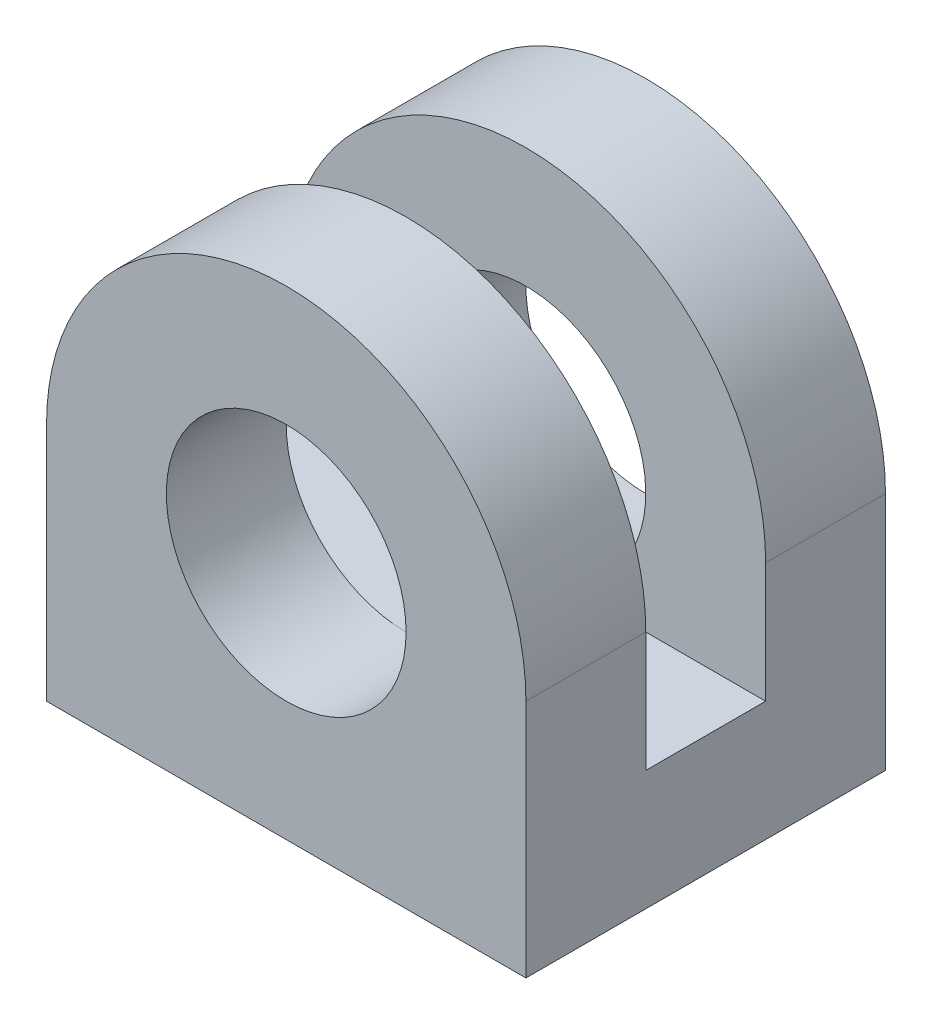
ISO-10303-21;
HEADER;
FILE_DESCRIPTION(('STEP AP214'),'2;1');
FILE_NAME('part.step','',(''),(''),'','','');
FILE_SCHEMA(('AUTOMOTIVE_DESIGN { 1 0 10303 214 1 1 1 1 }'));
ENDSEC;
DATA;
#1=APPLICATION_CONTEXT('core data for automotive mechanical design processes');
#2=APPLICATION_PROTOCOL_DEFINITION('international standard','automotive_design',2000,#1);
#3=PRODUCT_CONTEXT('',#1,'mechanical');
#4=PRODUCT('Part','Part','',(#3));
#5=PRODUCT_RELATED_PRODUCT_CATEGORY('part','',(#4));
#6=PRODUCT_DEFINITION_FORMATION('','',#4);
#7=PRODUCT_DEFINITION_CONTEXT('part definition',#1,'design');
#8=PRODUCT_DEFINITION('design','',#6,#7);
#9=PRODUCT_DEFINITION_SHAPE('','',#8);
#10=(LENGTH_UNIT() NAMED_UNIT(*) SI_UNIT(.MILLI.,.METRE.));
#11=(NAMED_UNIT(*) PLANE_ANGLE_UNIT() SI_UNIT($,.RADIAN.));
#12=(NAMED_UNIT(*) SI_UNIT($,.STERADIAN.) SOLID_ANGLE_UNIT());
#13=UNCERTAINTY_MEASURE_WITH_UNIT(LENGTH_MEASURE(1.E-05),#10,'distance_accuracy_value','');
#14=(GEOMETRIC_REPRESENTATION_CONTEXT(3) GLOBAL_UNCERTAINTY_ASSIGNED_CONTEXT((#13)) GLOBAL_UNIT_ASSIGNED_CONTEXT((#10,
#11,#12)) REPRESENTATION_CONTEXT('',''));
#15=CARTESIAN_POINT('',(0.,0.,0.));
#16=DIRECTION('',(0.,0.,1.));
#17=DIRECTION('',(1.,0.,0.));
#18=AXIS2_PLACEMENT_3D('',#15,#16,#17);
#19=CARTESIAN_POINT('',(0.,20.,15.));
#20=DIRECTION('',(0.,0.,-1.));
#21=DIRECTION('',(-1.,0.,0.));
#22=AXIS2_PLACEMENT_3D('',#19,#20,#21);
#23=CYLINDRICAL_SURFACE('',#22,20.);
#24=DIRECTION('',(0.,0.,-1.));
#25=VECTOR('',#24,1.);
#26=CARTESIAN_POINT('',(-20.,20.,15.));
#27=LINE('',#26,#25);
#28=CARTESIAN_POINT('',(-20.,20.,-5.));
#29=VERTEX_POINT('',#28);
#30=CARTESIAN_POINT('',(-20.,20.,-15.));
#31=VERTEX_POINT('',#30);
#32=EDGE_CURVE('E179',#29,#31,#27,.T.);
#33=ORIENTED_EDGE('',*,*,#32,.F.);
#34=CARTESIAN_POINT('',(0.,20.,-5.));
#35=DIRECTION('',(0.,0.,-1.));
#36=DIRECTION('',(0.,1.,0.));
#37=AXIS2_PLACEMENT_3D('',#34,#35,#36);
#38=CIRCLE('',#37,20.);
#39=CARTESIAN_POINT('',(20.,20.,-5.));
#40=VERTEX_POINT('',#39);
#41=EDGE_CURVE('E152',#29,#40,#38,.T.);
#42=ORIENTED_EDGE('',*,*,#41,.T.);
#43=DIRECTION('',(0.,0.,-1.));
#44=VECTOR('',#43,1.);
#45=CARTESIAN_POINT('',(20.,20.,15.));
#46=LINE('',#45,#44);
#47=CARTESIAN_POINT('',(20.,20.,-15.));
#48=VERTEX_POINT('',#47);
#49=EDGE_CURVE('E195',#40,#48,#46,.T.);
#50=ORIENTED_EDGE('',*,*,#49,.T.);
#51=CARTESIAN_POINT('',(0.,20.,-15.));
#52=DIRECTION('',(0.,0.,1.));
#53=DIRECTION('',(1.,0.,0.));
#54=AXIS2_PLACEMENT_3D('',#51,#52,#53);
#55=CIRCLE('',#54,20.);
#56=EDGE_CURVE('E170',#48,#31,#55,.T.);
#57=ORIENTED_EDGE('',*,*,#56,.T.);
#58=EDGE_LOOP('',(#33,#42,#50,#57));
#59=FACE_BOUND('',#58,.T.);
#60=ADVANCED_FACE('F39',(#59),#23,.T.);
#61=CARTESIAN_POINT('',(0.,20.,15.));
#62=DIRECTION('',(0.,0.,-1.));
#63=DIRECTION('',(-1.,0.,0.));
#64=AXIS2_PLACEMENT_3D('',#61,#62,#63);
#65=CYLINDRICAL_SURFACE('',#64,10.);
#66=CARTESIAN_POINT('',(0.,20.,-5.));
#67=DIRECTION('',(0.,0.,-1.));
#68=DIRECTION('',(0.,1.,0.));
#69=AXIS2_PLACEMENT_3D('',#66,#67,#68);
#70=CIRCLE('',#69,10.);
#71=CARTESIAN_POINT('',(0.,10.,-5.));
#72=VERTEX_POINT('',#71);
#73=EDGE_CURVE('E11',#72,#72,#70,.T.);
#74=ORIENTED_EDGE('',*,*,#73,.F.);
#75=EDGE_LOOP('',(#74));
#76=FACE_BOUND('',#75,.T.);
#77=CARTESIAN_POINT('',(0.,20.,-15.));
#78=DIRECTION('',(0.,0.,1.));
#79=DIRECTION('',(1.,0.,0.));
#80=AXIS2_PLACEMENT_3D('',#77,#78,#79);
#81=CIRCLE('',#80,10.);
#82=CARTESIAN_POINT('',(10.,20.,-15.));
#83=VERTEX_POINT('',#82);
#84=EDGE_CURVE('E156',#83,#83,#81,.T.);
#85=ORIENTED_EDGE('',*,*,#84,.F.);
#86=EDGE_LOOP('',(#85));
#87=FACE_BOUND('',#86,.T.);
#88=ADVANCED_FACE('F248',(#76,#87),#65,.F.);
#89=CARTESIAN_POINT('',(0.,20.,15.));
#90=DIRECTION('',(0.,0.,1.));
#91=DIRECTION('',(1.,0.,0.));
#92=AXIS2_PLACEMENT_3D('',#89,#90,#91);
#93=PLANE('',#92);
#94=DIRECTION('',(0.,-1.,0.));
#95=VECTOR('',#94,1.);
#96=CARTESIAN_POINT('',(-20.,20.,15.));
#97=LINE('',#96,#95);
#98=CARTESIAN_POINT('',(-20.,20.,15.));
#99=VERTEX_POINT('',#98);
#100=CARTESIAN_POINT('',(-20.,0.,15.));
#101=VERTEX_POINT('',#100);
#102=EDGE_CURVE('E165',#99,#101,#97,.T.);
#103=ORIENTED_EDGE('',*,*,#102,.T.);
#104=DIRECTION('',(1.,0.,0.));
#105=VECTOR('',#104,1.);
#106=CARTESIAN_POINT('',(-20.,0.,15.));
#107=LINE('',#106,#105);
#108=CARTESIAN_POINT('',(20.,0.,15.));
#109=VERTEX_POINT('',#108);
#110=EDGE_CURVE('E169',#101,#109,#107,.T.);
#111=ORIENTED_EDGE('',*,*,#110,.T.);
#112=DIRECTION('',(0.,1.,0.));
#113=VECTOR('',#112,1.);
#114=CARTESIAN_POINT('',(20.,0.,15.));
#115=LINE('',#114,#113);
#116=CARTESIAN_POINT('',(20.,20.,15.));
#117=VERTEX_POINT('',#116);
#118=EDGE_CURVE('E173',#109,#117,#115,.T.);
#119=ORIENTED_EDGE('',*,*,#118,.T.);
#120=CARTESIAN_POINT('',(0.,20.,15.));
#121=DIRECTION('',(0.,0.,1.));
#122=DIRECTION('',(1.,0.,0.));
#123=AXIS2_PLACEMENT_3D('',#120,#121,#122);
#124=CIRCLE('',#123,20.);
#125=EDGE_CURVE('E176',#117,#99,#124,.T.);
#126=ORIENTED_EDGE('',*,*,#125,.T.);
#127=EDGE_LOOP('',(#103,#111,#119,#126));
#128=FACE_BOUND('',#127,.T.);
#129=CARTESIAN_POINT('',(0.,20.,15.));
#130=DIRECTION('',(0.,0.,1.));
#131=DIRECTION('',(1.,0.,0.));
#132=AXIS2_PLACEMENT_3D('',#129,#130,#131);
#133=CIRCLE('',#132,10.);
#134=CARTESIAN_POINT('',(10.,20.,15.));
#135=VERTEX_POINT('',#134);
#136=EDGE_CURVE('E157',#135,#135,#133,.T.);
#137=ORIENTED_EDGE('',*,*,#136,.F.);
#138=EDGE_LOOP('',(#137));
#139=FACE_BOUND('',#138,.T.);
#140=ADVANCED_FACE('F234',(#128,#139),#93,.T.);
#141=CARTESIAN_POINT('',(0.,20.,-15.));
#142=DIRECTION('',(0.,0.,1.));
#143=DIRECTION('',(1.,0.,0.));
#144=AXIS2_PLACEMENT_3D('',#141,#142,#143);
#145=PLANE('',#144);
#146=DIRECTION('',(0.,-1.,0.));
#147=VECTOR('',#146,1.);
#148=CARTESIAN_POINT('',(-20.,20.,-15.));
#149=LINE('',#148,#147);
#150=CARTESIAN_POINT('',(-20.,0.,-15.));
#151=VERTEX_POINT('',#150);
#152=EDGE_CURVE('E161',#31,#151,#149,.T.);
#153=ORIENTED_EDGE('',*,*,#152,.F.);
#154=ORIENTED_EDGE('',*,*,#56,.F.);
#155=DIRECTION('',(0.,1.,0.));
#156=VECTOR('',#155,1.);
#157=CARTESIAN_POINT('',(20.,0.,-15.));
#158=LINE('',#157,#156);
#159=CARTESIAN_POINT('',(20.,0.,-15.));
#160=VERTEX_POINT('',#159);
#161=EDGE_CURVE('E186',#160,#48,#158,.T.);
#162=ORIENTED_EDGE('',*,*,#161,.F.);
#163=DIRECTION('',(1.,0.,0.));
#164=VECTOR('',#163,1.);
#165=CARTESIAN_POINT('',(-20.,0.,-15.));
#166=LINE('',#165,#164);
#167=EDGE_CURVE('E183',#151,#160,#166,.T.);
#168=ORIENTED_EDGE('',*,*,#167,.F.);
#169=EDGE_LOOP('',(#153,#154,#162,#168));
#170=FACE_BOUND('',#169,.T.);
#171=ORIENTED_EDGE('',*,*,#84,.T.);
#172=EDGE_LOOP('',(#171));
#173=FACE_BOUND('',#172,.T.);
#174=ADVANCED_FACE('F226',(#170,#173),#145,.F.);
#175=CARTESIAN_POINT('',(-20.,20.,15.));
#176=DIRECTION('',(1.,0.,0.));
#177=DIRECTION('',(0.,1.,0.));
#178=AXIS2_PLACEMENT_3D('',#175,#176,#177);
#179=PLANE('',#178);
#180=DIRECTION('',(0.,0.,-1.));
#181=VECTOR('',#180,1.);
#182=CARTESIAN_POINT('',(-20.,10.,5.));
#183=LINE('',#182,#181);
#184=CARTESIAN_POINT('',(-20.,10.,5.));
#185=VERTEX_POINT('',#184);
#186=CARTESIAN_POINT('',(-20.,10.,-5.));
#187=VERTEX_POINT('',#186);
#188=EDGE_CURVE('E121',#185,#187,#183,.T.);
#189=ORIENTED_EDGE('',*,*,#188,.T.);
#190=DIRECTION('',(0.,1.,0.));
#191=VECTOR('',#190,1.);
#192=CARTESIAN_POINT('',(-20.,10.,-5.));
#193=LINE('',#192,#191);
#194=EDGE_CURVE('E126',#187,#29,#193,.T.);
#195=ORIENTED_EDGE('',*,*,#194,.T.);
#196=ORIENTED_EDGE('',*,*,#32,.T.);
#197=ORIENTED_EDGE('',*,*,#152,.T.);
#198=DIRECTION('',(0.,0.,-1.));
#199=VECTOR('',#198,1.);
#200=CARTESIAN_POINT('',(-20.,0.,15.));
#201=LINE('',#200,#199);
#202=EDGE_CURVE('E204',#101,#151,#201,.T.);
#203=ORIENTED_EDGE('',*,*,#202,.F.);
#204=ORIENTED_EDGE('',*,*,#102,.F.);
#205=CARTESIAN_POINT('',(-20.,20.,5.));
#206=VERTEX_POINT('',#205);
#207=EDGE_CURVE('E131',#99,#206,#27,.T.);
#208=ORIENTED_EDGE('',*,*,#207,.T.);
#209=DIRECTION('',(0.,-1.,0.));
#210=VECTOR('',#209,1.);
#211=CARTESIAN_POINT('',(-20.,46.6812783255676,5.));
#212=LINE('',#211,#210);
#213=EDGE_CURVE('E55',#206,#185,#212,.T.);
#214=ORIENTED_EDGE('',*,*,#213,.T.);
#215=EDGE_LOOP('',(#189,#195,#196,#197,#203,#204,#208,#214));
#216=FACE_BOUND('',#215,.T.);
#217=ADVANCED_FACE('F41',(#216),#179,.F.);
#218=CARTESIAN_POINT('',(-20.,0.,15.));
#219=DIRECTION('',(0.,1.,0.));
#220=DIRECTION('',(-1.,0.,0.));
#221=AXIS2_PLACEMENT_3D('',#218,#219,#220);
#222=PLANE('',#221);
#223=ORIENTED_EDGE('',*,*,#167,.T.);
#224=DIRECTION('',(0.,0.,-1.));
#225=VECTOR('',#224,1.);
#226=CARTESIAN_POINT('',(20.,0.,15.));
#227=LINE('',#226,#225);
#228=EDGE_CURVE('E200',#109,#160,#227,.T.);
#229=ORIENTED_EDGE('',*,*,#228,.F.);
#230=ORIENTED_EDGE('',*,*,#110,.F.);
#231=ORIENTED_EDGE('',*,*,#202,.T.);
#232=EDGE_LOOP('',(#223,#229,#230,#231));
#233=FACE_BOUND('',#232,.T.);
#234=ADVANCED_FACE('F231',(#233),#222,.F.);
#235=CARTESIAN_POINT('',(20.,0.,15.));
#236=DIRECTION('',(-1.,0.,0.));
#237=DIRECTION('',(0.,0.,1.));
#238=AXIS2_PLACEMENT_3D('',#235,#236,#237);
#239=PLANE('',#238);
#240=ORIENTED_EDGE('',*,*,#49,.F.);
#241=DIRECTION('',(0.,1.,0.));
#242=VECTOR('',#241,1.);
#243=CARTESIAN_POINT('',(20.,10.,-5.));
#244=LINE('',#243,#242);
#245=CARTESIAN_POINT('',(20.,10.,-5.));
#246=VERTEX_POINT('',#245);
#247=EDGE_CURVE('E133',#246,#40,#244,.T.);
#248=ORIENTED_EDGE('',*,*,#247,.F.);
#249=DIRECTION('',(0.,0.,-1.));
#250=VECTOR('',#249,1.);
#251=CARTESIAN_POINT('',(20.,10.,5.));
#252=LINE('',#251,#250);
#253=CARTESIAN_POINT('',(20.,10.,5.));
#254=VERTEX_POINT('',#253);
#255=EDGE_CURVE('E136',#254,#246,#252,.T.);
#256=ORIENTED_EDGE('',*,*,#255,.F.);
#257=DIRECTION('',(0.,-1.,0.));
#258=VECTOR('',#257,1.);
#259=CARTESIAN_POINT('',(20.,46.6812783255676,5.));
#260=LINE('',#259,#258);
#261=CARTESIAN_POINT('',(20.,20.,5.));
#262=VERTEX_POINT('',#261);
#263=EDGE_CURVE('E141',#262,#254,#260,.T.);
#264=ORIENTED_EDGE('',*,*,#263,.F.);
#265=EDGE_CURVE('E196',#117,#262,#46,.T.);
#266=ORIENTED_EDGE('',*,*,#265,.F.);
#267=ORIENTED_EDGE('',*,*,#118,.F.);
#268=ORIENTED_EDGE('',*,*,#228,.T.);
#269=ORIENTED_EDGE('',*,*,#161,.T.);
#270=EDGE_LOOP('',(#240,#248,#256,#264,#266,#267,#268,#269));
#271=FACE_BOUND('',#270,.T.);
#272=ADVANCED_FACE('F218',(#271),#239,.F.);
#273=ORIENTED_EDGE('',*,*,#265,.T.);
#274=CARTESIAN_POINT('',(0.,20.,5.));
#275=DIRECTION('',(0.,0.,1.));
#276=DIRECTION('',(0.,-1.,0.));
#277=AXIS2_PLACEMENT_3D('',#274,#275,#276);
#278=CIRCLE('',#277,20.);
#279=EDGE_CURVE('E148',#262,#206,#278,.T.);
#280=ORIENTED_EDGE('',*,*,#279,.T.);
#281=ORIENTED_EDGE('',*,*,#207,.F.);
#282=ORIENTED_EDGE('',*,*,#125,.F.);
#283=EDGE_LOOP('',(#273,#280,#281,#282));
#284=FACE_BOUND('',#283,.T.);
#285=ADVANCED_FACE('F238',(#284),#23,.T.);
#286=CARTESIAN_POINT('',(0.,20.,5.));
#287=DIRECTION('',(0.,0.,1.));
#288=DIRECTION('',(0.,-1.,0.));
#289=AXIS2_PLACEMENT_3D('',#286,#287,#288);
#290=CIRCLE('',#289,10.);
#291=CARTESIAN_POINT('',(0.,10.,5.));
#292=VERTEX_POINT('',#291);
#293=EDGE_CURVE('E48',#292,#292,#290,.T.);
#294=ORIENTED_EDGE('',*,*,#293,.F.);
#295=EDGE_LOOP('',(#294));
#296=FACE_BOUND('',#295,.T.);
#297=ORIENTED_EDGE('',*,*,#136,.T.);
#298=EDGE_LOOP('',(#297));
#299=FACE_BOUND('',#298,.T.);
#300=ADVANCED_FACE('F240',(#296,#299),#65,.F.);
#301=CARTESIAN_POINT('',(-20.,10.,-5.));
#302=DIRECTION('',(0.,0.,-1.));
#303=DIRECTION('',(0.,1.,0.));
#304=AXIS2_PLACEMENT_3D('',#301,#302,#303);
#305=PLANE('',#304);
#306=ORIENTED_EDGE('',*,*,#194,.F.);
#307=DIRECTION('',(1.,0.,0.));
#308=VECTOR('',#307,1.);
#309=CARTESIAN_POINT('',(-20.,10.,-5.));
#310=LINE('',#309,#308);
#311=EDGE_CURVE('E62',#187,#72,#310,.T.);
#312=ORIENTED_EDGE('',*,*,#311,.T.);
#313=ORIENTED_EDGE('',*,*,#73,.T.);
#314=EDGE_CURVE('E117',#72,#246,#310,.T.);
#315=ORIENTED_EDGE('',*,*,#314,.T.);
#316=ORIENTED_EDGE('',*,*,#247,.T.);
#317=ORIENTED_EDGE('',*,*,#41,.F.);
#318=EDGE_LOOP('',(#306,#312,#313,#315,#316,#317));
#319=FACE_BOUND('',#318,.T.);
#320=ADVANCED_FACE('F219',(#319),#305,.F.);
#321=CARTESIAN_POINT('',(-20.,10.,5.));
#322=DIRECTION('',(0.,-1.,0.));
#323=DIRECTION('',(0.,0.,-1.));
#324=AXIS2_PLACEMENT_3D('',#321,#322,#323);
#325=PLANE('',#324);
#326=DIRECTION('',(1.,0.,0.));
#327=VECTOR('',#326,1.);
#328=CARTESIAN_POINT('',(-20.,10.,5.));
#329=LINE('',#328,#327);
#330=EDGE_CURVE('E118',#292,#254,#329,.T.);
#331=ORIENTED_EDGE('',*,*,#330,.T.);
#332=ORIENTED_EDGE('',*,*,#255,.T.);
#333=ORIENTED_EDGE('',*,*,#314,.F.);
#334=ORIENTED_EDGE('',*,*,#311,.F.);
#335=ORIENTED_EDGE('',*,*,#188,.F.);
#336=EDGE_CURVE('E109',#185,#292,#329,.T.);
#337=ORIENTED_EDGE('',*,*,#336,.T.);
#338=EDGE_LOOP('',(#331,#332,#333,#334,#335,#337));
#339=FACE_BOUND('',#338,.T.);
#340=ADVANCED_FACE('F122',(#339),#325,.F.);
#341=CARTESIAN_POINT('',(-20.,46.6812783255676,5.));
#342=DIRECTION('',(0.,0.,1.));
#343=DIRECTION('',(0.,-1.,0.));
#344=AXIS2_PLACEMENT_3D('',#341,#342,#343);
#345=PLANE('',#344);
#346=ORIENTED_EDGE('',*,*,#263,.T.);
#347=ORIENTED_EDGE('',*,*,#330,.F.);
#348=ORIENTED_EDGE('',*,*,#293,.T.);
#349=ORIENTED_EDGE('',*,*,#336,.F.);
#350=ORIENTED_EDGE('',*,*,#213,.F.);
#351=ORIENTED_EDGE('',*,*,#279,.F.);
#352=EDGE_LOOP('',(#346,#347,#348,#349,#350,#351));
#353=FACE_BOUND('',#352,.T.);
#354=ADVANCED_FACE('F112',(#353),#345,.F.);
#355=CLOSED_SHELL('',(#60,#88,#140,#174,#217,#234,#272,#285,#300,#320,#340,#354));
#356=MANIFOLD_SOLID_BREP('B2',#355);
#357=ADVANCED_BREP_SHAPE_REPRESENTATION('',(#18,#356),#14);
#358=SHAPE_DEFINITION_REPRESENTATION(#9,#357);
ENDSEC;
END-ISO-10303-21;
